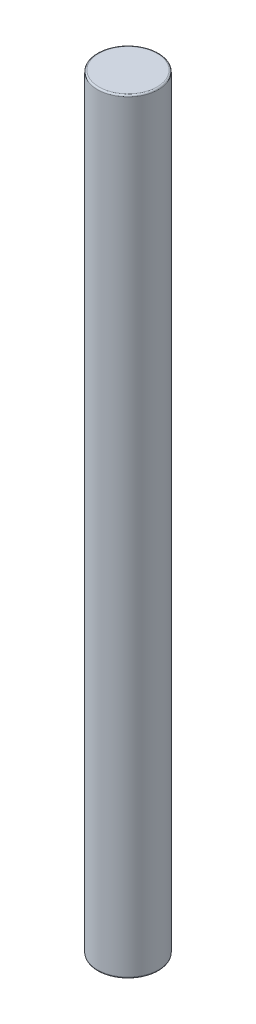
ISO-10303-21;
HEADER;
FILE_DESCRIPTION(('STEP AP214'),'2;1');
FILE_NAME('part.step','',(''),(''),'','','');
FILE_SCHEMA(('AUTOMOTIVE_DESIGN { 1 0 10303 214 1 1 1 1 }'));
ENDSEC;
DATA;
#1=APPLICATION_CONTEXT('core data for automotive mechanical design processes');
#2=APPLICATION_PROTOCOL_DEFINITION('international standard','automotive_design',2000,#1);
#3=PRODUCT_CONTEXT('',#1,'mechanical');
#4=PRODUCT('Part','Part','',(#3));
#5=PRODUCT_RELATED_PRODUCT_CATEGORY('part','',(#4));
#6=PRODUCT_DEFINITION_FORMATION('','',#4);
#7=PRODUCT_DEFINITION_CONTEXT('part definition',#1,'design');
#8=PRODUCT_DEFINITION('design','',#6,#7);
#9=PRODUCT_DEFINITION_SHAPE('','',#8);
#10=(LENGTH_UNIT() NAMED_UNIT(*) SI_UNIT(.MILLI.,.METRE.));
#11=(NAMED_UNIT(*) PLANE_ANGLE_UNIT() SI_UNIT($,.RADIAN.));
#12=(NAMED_UNIT(*) SI_UNIT($,.STERADIAN.) SOLID_ANGLE_UNIT());
#13=UNCERTAINTY_MEASURE_WITH_UNIT(LENGTH_MEASURE(1.E-05),#10,'distance_accuracy_value','');
#14=(GEOMETRIC_REPRESENTATION_CONTEXT(3) GLOBAL_UNCERTAINTY_ASSIGNED_CONTEXT((#13)) GLOBAL_UNIT_ASSIGNED_CONTEXT((#10,
#11,#12)) REPRESENTATION_CONTEXT('',''));
#15=CARTESIAN_POINT('',(0.,0.,0.));
#16=DIRECTION('',(0.,0.,1.));
#17=DIRECTION('',(1.,0.,0.));
#18=AXIS2_PLACEMENT_3D('',#15,#16,#17);
#19=CARTESIAN_POINT('',(0.,100.,0.));
#20=DIRECTION('',(0.,-1.,0.));
#21=DIRECTION('',(0.,0.,-1.));
#22=AXIS2_PLACEMENT_3D('',#19,#20,#21);
#23=CYLINDRICAL_SURFACE('',#22,4.);
#24=CARTESIAN_POINT('',(0.,0.200000000000006,0.));
#25=DIRECTION('',(0.,1.,0.));
#26=DIRECTION('',(0.,0.,1.));
#27=AXIS2_PLACEMENT_3D('',#24,#25,#26);
#28=CIRCLE('',#27,4.);
#29=CARTESIAN_POINT('',(0.,0.200000000000006,4.));
#30=VERTEX_POINT('',#29);
#31=EDGE_CURVE('E50',#30,#30,#28,.T.);
#32=ORIENTED_EDGE('',*,*,#31,.T.);
#33=EDGE_LOOP('',(#32));
#34=FACE_BOUND('',#33,.T.);
#35=CARTESIAN_POINT('',(0.,99.8,0.));
#36=DIRECTION('',(0.,1.,0.));
#37=DIRECTION('',(0.,0.,1.));
#38=AXIS2_PLACEMENT_3D('',#35,#36,#37);
#39=CIRCLE('',#38,4.);
#40=CARTESIAN_POINT('',(0.,99.8,4.));
#41=VERTEX_POINT('',#40);
#42=EDGE_CURVE('E55',#41,#41,#39,.F.);
#43=ORIENTED_EDGE('',*,*,#42,.T.);
#44=EDGE_LOOP('',(#43));
#45=FACE_BOUND('',#44,.T.);
#46=ADVANCED_FACE('F37',(#34,#45),#23,.T.);
#47=CARTESIAN_POINT('',(0.,100.,0.));
#48=DIRECTION('',(0.,1.,0.));
#49=DIRECTION('',(0.,0.,1.));
#50=AXIS2_PLACEMENT_3D('',#47,#48,#49);
#51=PLANE('',#50);
#52=CARTESIAN_POINT('',(0.,100.,0.));
#53=DIRECTION('',(0.,1.,0.));
#54=DIRECTION('',(0.,0.,1.));
#55=AXIS2_PLACEMENT_3D('',#52,#53,#54);
#56=CIRCLE('',#55,3.8);
#57=CARTESIAN_POINT('',(0.,100.,3.8));
#58=VERTEX_POINT('',#57);
#59=EDGE_CURVE('E10',#58,#58,#56,.T.);
#60=ORIENTED_EDGE('',*,*,#59,.T.);
#61=EDGE_LOOP('',(#60));
#62=FACE_BOUND('',#61,.T.);
#63=ADVANCED_FACE('F72',(#62),#51,.T.);
#64=CARTESIAN_POINT('',(0.,0.,0.));
#65=DIRECTION('',(0.,1.,0.));
#66=DIRECTION('',(0.,0.,1.));
#67=AXIS2_PLACEMENT_3D('',#64,#65,#66);
#68=PLANE('',#67);
#69=CARTESIAN_POINT('',(0.,0.,0.));
#70=DIRECTION('',(0.,1.,0.));
#71=DIRECTION('',(0.,0.,1.));
#72=AXIS2_PLACEMENT_3D('',#69,#70,#71);
#73=CIRCLE('',#72,3.8);
#74=CARTESIAN_POINT('',(0.,0.,3.8));
#75=VERTEX_POINT('',#74);
#76=EDGE_CURVE('E45',#75,#75,#73,.F.);
#77=ORIENTED_EDGE('',*,*,#76,.T.);
#78=EDGE_LOOP('',(#77));
#79=FACE_BOUND('',#78,.T.);
#80=ADVANCED_FACE('F69',(#79),#68,.F.);
#81=CARTESIAN_POINT('',(0.,0.200000000000006,0.));
#82=DIRECTION('',(0.,1.,0.));
#83=DIRECTION('',(0.,0.,1.));
#84=AXIS2_PLACEMENT_3D('',#81,#82,#83);
#85=TOROIDAL_SURFACE('',#84,3.8,0.2);
#86=ORIENTED_EDGE('',*,*,#76,.F.);
#87=EDGE_LOOP('',(#86));
#88=FACE_BOUND('',#87,.T.);
#89=ORIENTED_EDGE('',*,*,#31,.F.);
#90=EDGE_LOOP('',(#89));
#91=FACE_BOUND('',#90,.T.);
#92=ADVANCED_FACE('F65',(#88,#91),#85,.T.);
#93=CARTESIAN_POINT('',(0.,99.8,0.));
#94=DIRECTION('',(0.,1.,0.));
#95=DIRECTION('',(0.,0.,1.));
#96=AXIS2_PLACEMENT_3D('',#93,#94,#95);
#97=TOROIDAL_SURFACE('',#96,3.8,0.2);
#98=ORIENTED_EDGE('',*,*,#42,.F.);
#99=EDGE_LOOP('',(#98));
#100=FACE_BOUND('',#99,.T.);
#101=ORIENTED_EDGE('',*,*,#59,.F.);
#102=EDGE_LOOP('',(#101));
#103=FACE_BOUND('',#102,.T.);
#104=ADVANCED_FACE('F39',(#100,#103),#97,.T.);
#105=CLOSED_SHELL('',(#46,#63,#80,#92,#104));
#106=MANIFOLD_SOLID_BREP('B2',#105);
#107=ADVANCED_BREP_SHAPE_REPRESENTATION('',(#18,#106),#14);
#108=SHAPE_DEFINITION_REPRESENTATION(#9,#107);
ENDSEC;
END-ISO-10303-21;
